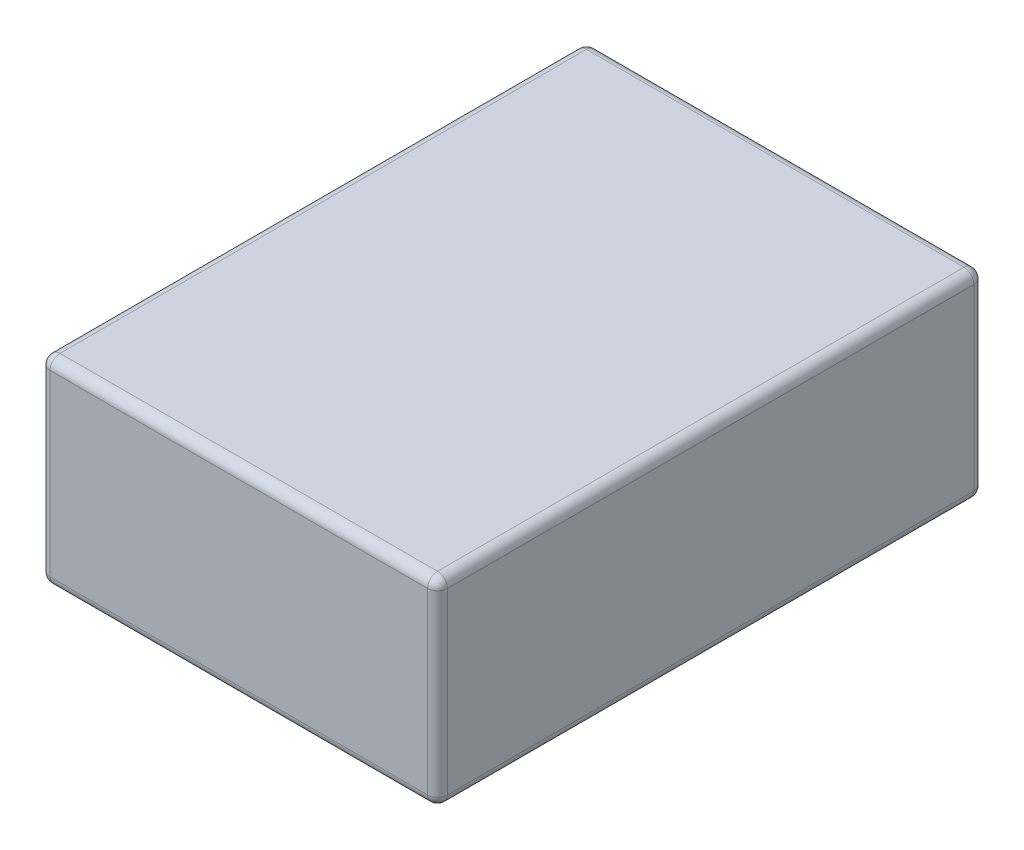
ISO-10303-21;
HEADER;
FILE_DESCRIPTION(('STEP AP214'),'2;1');
FILE_NAME('part.step','',(''),(''),'','','');
FILE_SCHEMA(('AUTOMOTIVE_DESIGN { 1 0 10303 214 1 1 1 1 }'));
ENDSEC;
DATA;
#1=APPLICATION_CONTEXT('core data for automotive mechanical design processes');
#2=APPLICATION_PROTOCOL_DEFINITION('international standard','automotive_design',2000,#1);
#3=PRODUCT_CONTEXT('',#1,'mechanical');
#4=PRODUCT('Part','Part','',(#3));
#5=PRODUCT_RELATED_PRODUCT_CATEGORY('part','',(#4));
#6=PRODUCT_DEFINITION_FORMATION('','',#4);
#7=PRODUCT_DEFINITION_CONTEXT('part definition',#1,'design');
#8=PRODUCT_DEFINITION('design','',#6,#7);
#9=PRODUCT_DEFINITION_SHAPE('','',#8);
#10=(LENGTH_UNIT() NAMED_UNIT(*) SI_UNIT(.MILLI.,.METRE.));
#11=(NAMED_UNIT(*) PLANE_ANGLE_UNIT() SI_UNIT($,.RADIAN.));
#12=(NAMED_UNIT(*) SI_UNIT($,.STERADIAN.) SOLID_ANGLE_UNIT());
#13=UNCERTAINTY_MEASURE_WITH_UNIT(LENGTH_MEASURE(1.E-05),#10,'distance_accuracy_value','');
#14=(GEOMETRIC_REPRESENTATION_CONTEXT(3) GLOBAL_UNCERTAINTY_ASSIGNED_CONTEXT((#13)) GLOBAL_UNIT_ASSIGNED_CONTEXT((#10,
#11,#12)) REPRESENTATION_CONTEXT('',''));
#15=CARTESIAN_POINT('',(0.,0.,0.));
#16=DIRECTION('',(0.,0.,1.));
#17=DIRECTION('',(1.,0.,0.));
#18=AXIS2_PLACEMENT_3D('',#15,#16,#17);
#19=CARTESIAN_POINT('',(0.,20.,0.));
#20=DIRECTION('',(1.,0.,0.));
#21=DIRECTION('',(0.,0.,-1.));
#22=AXIS2_PLACEMENT_3D('',#19,#20,#21);
#23=PLANE('',#22);
#24=DIRECTION('',(0.,-1.,0.));
#25=VECTOR('',#24,1.);
#26=CARTESIAN_POINT('',(0.,20.,-1.));
#27=LINE('',#26,#25);
#28=CARTESIAN_POINT('',(0.,1.,-1.));
#29=VERTEX_POINT('',#28);
#30=CARTESIAN_POINT('',(0.,19.,-1.));
#31=VERTEX_POINT('',#30);
#32=EDGE_CURVE('E137',#29,#31,#27,.F.);
#33=ORIENTED_EDGE('',*,*,#32,.T.);
#34=DIRECTION('',(0.,0.,1.));
#35=VECTOR('',#34,1.);
#36=CARTESIAN_POINT('',(0.,19.,0.));
#37=LINE('',#36,#35);
#38=CARTESIAN_POINT('',(0.,19.,-54.));
#39=VERTEX_POINT('',#38);
#40=EDGE_CURVE('E174',#31,#39,#37,.F.);
#41=ORIENTED_EDGE('',*,*,#40,.T.);
#42=DIRECTION('',(0.,-1.,0.));
#43=VECTOR('',#42,1.);
#44=CARTESIAN_POINT('',(0.,20.,-54.));
#45=LINE('',#44,#43);
#46=CARTESIAN_POINT('',(0.,1.,-54.));
#47=VERTEX_POINT('',#46);
#48=EDGE_CURVE('E171',#39,#47,#45,.T.);
#49=ORIENTED_EDGE('',*,*,#48,.T.);
#50=DIRECTION('',(0.,0.,1.));
#51=VECTOR('',#50,1.);
#52=CARTESIAN_POINT('',(0.,1.,0.));
#53=LINE('',#52,#51);
#54=EDGE_CURVE('E166',#47,#29,#53,.T.);
#55=ORIENTED_EDGE('',*,*,#54,.T.);
#56=EDGE_LOOP('',(#33,#41,#49,#55));
#57=FACE_BOUND('',#56,.T.);
#58=ADVANCED_FACE('F41',(#57),#23,.F.);
#59=CARTESIAN_POINT('',(0.,20.,0.));
#60=DIRECTION('',(0.,0.,-1.));
#61=DIRECTION('',(-1.,0.,0.));
#62=AXIS2_PLACEMENT_3D('',#59,#60,#61);
#63=PLANE('',#62);
#64=DIRECTION('',(0.,-1.,0.));
#65=VECTOR('',#64,1.);
#66=CARTESIAN_POINT('',(39.,20.,0.));
#67=LINE('',#66,#65);
#68=CARTESIAN_POINT('',(39.,1.,0.));
#69=VERTEX_POINT('',#68);
#70=CARTESIAN_POINT('',(39.,19.,0.));
#71=VERTEX_POINT('',#70);
#72=EDGE_CURVE('E159',#69,#71,#67,.F.);
#73=ORIENTED_EDGE('',*,*,#72,.T.);
#74=DIRECTION('',(1.,0.,0.));
#75=VECTOR('',#74,1.);
#76=CARTESIAN_POINT('',(0.,19.,0.));
#77=LINE('',#76,#75);
#78=CARTESIAN_POINT('',(1.,19.,0.));
#79=VERTEX_POINT('',#78);
#80=EDGE_CURVE('E163',#71,#79,#77,.F.);
#81=ORIENTED_EDGE('',*,*,#80,.T.);
#82=DIRECTION('',(0.,-1.,0.));
#83=VECTOR('',#82,1.);
#84=CARTESIAN_POINT('',(1.,20.,0.));
#85=LINE('',#84,#83);
#86=CARTESIAN_POINT('',(1.,1.,0.));
#87=VERTEX_POINT('',#86);
#88=EDGE_CURVE('E135',#79,#87,#85,.T.);
#89=ORIENTED_EDGE('',*,*,#88,.T.);
#90=DIRECTION('',(1.,0.,0.));
#91=VECTOR('',#90,1.);
#92=CARTESIAN_POINT('',(40.,1.,0.));
#93=LINE('',#92,#91);
#94=EDGE_CURVE('E153',#87,#69,#93,.T.);
#95=ORIENTED_EDGE('',*,*,#94,.T.);
#96=EDGE_LOOP('',(#73,#81,#89,#95));
#97=FACE_BOUND('',#96,.T.);
#98=ADVANCED_FACE('F161',(#97),#63,.F.);
#99=CARTESIAN_POINT('',(40.,20.,0.));
#100=DIRECTION('',(-1.,0.,0.));
#101=DIRECTION('',(0.,0.,1.));
#102=AXIS2_PLACEMENT_3D('',#99,#100,#101);
#103=PLANE('',#102);
#104=DIRECTION('',(0.,-1.,0.));
#105=VECTOR('',#104,1.);
#106=CARTESIAN_POINT('',(40.,20.,-54.));
#107=LINE('',#106,#105);
#108=CARTESIAN_POINT('',(40.,1.,-54.));
#109=VERTEX_POINT('',#108);
#110=CARTESIAN_POINT('',(40.,19.,-54.));
#111=VERTEX_POINT('',#110);
#112=EDGE_CURVE('E178',#109,#111,#107,.F.);
#113=ORIENTED_EDGE('',*,*,#112,.T.);
#114=DIRECTION('',(0.,0.,-1.));
#115=VECTOR('',#114,1.);
#116=CARTESIAN_POINT('',(40.,19.,0.));
#117=LINE('',#116,#115);
#118=CARTESIAN_POINT('',(40.,19.,-1.));
#119=VERTEX_POINT('',#118);
#120=EDGE_CURVE('E183',#111,#119,#117,.F.);
#121=ORIENTED_EDGE('',*,*,#120,.T.);
#122=DIRECTION('',(0.,-1.,0.));
#123=VECTOR('',#122,1.);
#124=CARTESIAN_POINT('',(40.,20.,-1.));
#125=LINE('',#124,#123);
#126=CARTESIAN_POINT('',(40.,1.,-1.));
#127=VERTEX_POINT('',#126);
#128=EDGE_CURVE('E180',#119,#127,#125,.T.);
#129=ORIENTED_EDGE('',*,*,#128,.T.);
#130=DIRECTION('',(0.,0.,-1.));
#131=VECTOR('',#130,1.);
#132=CARTESIAN_POINT('',(40.,1.,-55.));
#133=LINE('',#132,#131);
#134=EDGE_CURVE('E176',#127,#109,#133,.T.);
#135=ORIENTED_EDGE('',*,*,#134,.T.);
#136=EDGE_LOOP('',(#113,#121,#129,#135));
#137=FACE_BOUND('',#136,.T.);
#138=ADVANCED_FACE('F288',(#137),#103,.F.);
#139=CARTESIAN_POINT('',(0.,20.,-55.));
#140=DIRECTION('',(0.,0.,1.));
#141=DIRECTION('',(1.,0.,0.));
#142=AXIS2_PLACEMENT_3D('',#139,#140,#141);
#143=PLANE('',#142);
#144=DIRECTION('',(0.,-1.,0.));
#145=VECTOR('',#144,1.);
#146=CARTESIAN_POINT('',(1.,20.,-55.));
#147=LINE('',#146,#145);
#148=CARTESIAN_POINT('',(1.,1.,-55.));
#149=VERTEX_POINT('',#148);
#150=CARTESIAN_POINT('',(1.,19.,-55.));
#151=VERTEX_POINT('',#150);
#152=EDGE_CURVE('E187',#149,#151,#147,.F.);
#153=ORIENTED_EDGE('',*,*,#152,.T.);
#154=DIRECTION('',(-1.,0.,0.));
#155=VECTOR('',#154,1.);
#156=CARTESIAN_POINT('',(0.,19.,-55.));
#157=LINE('',#156,#155);
#158=CARTESIAN_POINT('',(39.,19.,-55.));
#159=VERTEX_POINT('',#158);
#160=EDGE_CURVE('E192',#151,#159,#157,.F.);
#161=ORIENTED_EDGE('',*,*,#160,.T.);
#162=DIRECTION('',(0.,-1.,0.));
#163=VECTOR('',#162,1.);
#164=CARTESIAN_POINT('',(39.,20.,-55.));
#165=LINE('',#164,#163);
#166=CARTESIAN_POINT('',(39.,1.,-55.));
#167=VERTEX_POINT('',#166);
#168=EDGE_CURVE('E189',#159,#167,#165,.T.);
#169=ORIENTED_EDGE('',*,*,#168,.T.);
#170=DIRECTION('',(-1.,0.,0.));
#171=VECTOR('',#170,1.);
#172=CARTESIAN_POINT('',(0.,1.,-55.));
#173=LINE('',#172,#171);
#174=EDGE_CURVE('E185',#167,#149,#173,.T.);
#175=ORIENTED_EDGE('',*,*,#174,.T.);
#176=EDGE_LOOP('',(#153,#161,#169,#175));
#177=FACE_BOUND('',#176,.T.);
#178=ADVANCED_FACE('F299',(#177),#143,.F.);
#179=CARTESIAN_POINT('',(0.,20.,0.));
#180=DIRECTION('',(0.,-1.,0.));
#181=DIRECTION('',(0.,0.,-1.));
#182=AXIS2_PLACEMENT_3D('',#179,#180,#181);
#183=PLANE('',#182);
#184=DIRECTION('',(0.,0.,-1.));
#185=VECTOR('',#184,1.);
#186=CARTESIAN_POINT('',(39.,20.,0.));
#187=LINE('',#186,#185);
#188=CARTESIAN_POINT('',(39.,20.,-1.));
#189=VERTEX_POINT('',#188);
#190=CARTESIAN_POINT('',(39.,20.,-54.));
#191=VERTEX_POINT('',#190);
#192=EDGE_CURVE('E198',#189,#191,#187,.T.);
#193=ORIENTED_EDGE('',*,*,#192,.T.);
#194=DIRECTION('',(-1.,0.,0.));
#195=VECTOR('',#194,1.);
#196=CARTESIAN_POINT('',(0.,20.,-54.));
#197=LINE('',#196,#195);
#198=CARTESIAN_POINT('',(1.,20.,-54.));
#199=VERTEX_POINT('',#198);
#200=EDGE_CURVE('E200',#191,#199,#197,.T.);
#201=ORIENTED_EDGE('',*,*,#200,.T.);
#202=DIRECTION('',(0.,0.,1.));
#203=VECTOR('',#202,1.);
#204=CARTESIAN_POINT('',(1.,20.,0.));
#205=LINE('',#204,#203);
#206=CARTESIAN_POINT('',(1.,20.,-1.));
#207=VERTEX_POINT('',#206);
#208=EDGE_CURVE('E194',#199,#207,#205,.T.);
#209=ORIENTED_EDGE('',*,*,#208,.T.);
#210=DIRECTION('',(1.,0.,0.));
#211=VECTOR('',#210,1.);
#212=CARTESIAN_POINT('',(0.,20.,-1.));
#213=LINE('',#212,#211);
#214=EDGE_CURVE('E196',#207,#189,#213,.T.);
#215=ORIENTED_EDGE('',*,*,#214,.T.);
#216=EDGE_LOOP('',(#193,#201,#209,#215));
#217=FACE_BOUND('',#216,.T.);
#218=ADVANCED_FACE('F280',(#217),#183,.F.);
#219=CARTESIAN_POINT('',(0.,0.,0.));
#220=DIRECTION('',(0.,-1.,0.));
#221=DIRECTION('',(0.,0.,-1.));
#222=AXIS2_PLACEMENT_3D('',#219,#220,#221);
#223=PLANE('',#222);
#224=DIRECTION('',(0.,0.,-1.));
#225=VECTOR('',#224,1.);
#226=CARTESIAN_POINT('',(39.,0.,0.));
#227=LINE('',#226,#225);
#228=CARTESIAN_POINT('',(39.,0.,-54.));
#229=VERTEX_POINT('',#228);
#230=CARTESIAN_POINT('',(39.,0.,-1.));
#231=VERTEX_POINT('',#230);
#232=EDGE_CURVE('E50',#229,#231,#227,.F.);
#233=ORIENTED_EDGE('',*,*,#232,.T.);
#234=DIRECTION('',(1.,0.,0.));
#235=VECTOR('',#234,1.);
#236=CARTESIAN_POINT('',(0.,0.,-1.));
#237=LINE('',#236,#235);
#238=CARTESIAN_POINT('',(1.,0.,-1.));
#239=VERTEX_POINT('',#238);
#240=EDGE_CURVE('E12',#231,#239,#237,.F.);
#241=ORIENTED_EDGE('',*,*,#240,.T.);
#242=DIRECTION('',(0.,0.,1.));
#243=VECTOR('',#242,1.);
#244=CARTESIAN_POINT('',(1.,0.,-55.));
#245=LINE('',#244,#243);
#246=CARTESIAN_POINT('',(1.,0.,-54.));
#247=VERTEX_POINT('',#246);
#248=EDGE_CURVE('E203',#239,#247,#245,.F.);
#249=ORIENTED_EDGE('',*,*,#248,.T.);
#250=DIRECTION('',(-1.,0.,0.));
#251=VECTOR('',#250,1.);
#252=CARTESIAN_POINT('',(40.,0.,-54.));
#253=LINE('',#252,#251);
#254=EDGE_CURVE('E61',#247,#229,#253,.F.);
#255=ORIENTED_EDGE('',*,*,#254,.T.);
#256=EDGE_LOOP('',(#233,#241,#249,#255));
#257=FACE_BOUND('',#256,.T.);
#258=ADVANCED_FACE('F401',(#257),#223,.T.);
#259=CARTESIAN_POINT('',(39.,20.,-54.));
#260=DIRECTION('',(0.,-1.,0.));
#261=DIRECTION('',(0.,0.,-1.));
#262=AXIS2_PLACEMENT_3D('',#259,#260,#261);
#263=CYLINDRICAL_SURFACE('',#262,1.);
#264=CARTESIAN_POINT('',(39.,19.,-54.));
#265=DIRECTION('',(0.,1.,0.));
#266=DIRECTION('',(0.,0.,1.));
#267=AXIS2_PLACEMENT_3D('',#264,#265,#266);
#268=CIRCLE('',#267,1.);
#269=EDGE_CURVE('E45',#111,#159,#268,.T.);
#270=ORIENTED_EDGE('',*,*,#269,.F.);
#271=ORIENTED_EDGE('',*,*,#112,.F.);
#272=CARTESIAN_POINT('',(39.,1.,-54.));
#273=DIRECTION('',(0.,-1.,0.));
#274=DIRECTION('',(0.,0.,-1.));
#275=AXIS2_PLACEMENT_3D('',#272,#273,#274);
#276=CIRCLE('',#275,1.);
#277=EDGE_CURVE('E257',#167,#109,#276,.T.);
#278=ORIENTED_EDGE('',*,*,#277,.F.);
#279=ORIENTED_EDGE('',*,*,#168,.F.);
#280=EDGE_LOOP('',(#270,#271,#278,#279));
#281=FACE_BOUND('',#280,.T.);
#282=ADVANCED_FACE('F43',(#281),#263,.T.);
#283=CARTESIAN_POINT('',(39.,19.,-54.));
#284=DIRECTION('',(0.,0.,-1.));
#285=DIRECTION('',(-1.,0.,0.));
#286=AXIS2_PLACEMENT_3D('',#283,#284,#285);
#287=SPHERICAL_SURFACE('',#286,1.);
#288=CARTESIAN_POINT('',(39.,19.,-54.));
#289=DIRECTION('',(0.,0.,-1.));
#290=DIRECTION('',(-1.,0.,0.));
#291=AXIS2_PLACEMENT_3D('',#288,#289,#290);
#292=CIRCLE('',#291,1.);
#293=EDGE_CURVE('E252',#111,#191,#292,.F.);
#294=ORIENTED_EDGE('',*,*,#293,.F.);
#295=ORIENTED_EDGE('',*,*,#269,.T.);
#296=CARTESIAN_POINT('',(39.,19.,-54.));
#297=DIRECTION('',(1.,0.,0.));
#298=DIRECTION('',(0.,0.,-1.));
#299=AXIS2_PLACEMENT_3D('',#296,#297,#298);
#300=CIRCLE('',#299,1.);
#301=EDGE_CURVE('E255',#191,#159,#300,.F.);
#302=ORIENTED_EDGE('',*,*,#301,.F.);
#303=EDGE_LOOP('',(#294,#295,#302));
#304=FACE_BOUND('',#303,.T.);
#305=ADVANCED_FACE('F268',(#304),#287,.T.);
#306=CARTESIAN_POINT('',(39.,1.,-54.));
#307=DIRECTION('',(1.,0.,0.));
#308=DIRECTION('',(0.,1.,0.));
#309=AXIS2_PLACEMENT_3D('',#306,#307,#308);
#310=SPHERICAL_SURFACE('',#309,1.);
#311=CARTESIAN_POINT('',(39.,1.,-54.));
#312=DIRECTION('',(1.,0.,0.));
#313=DIRECTION('',(0.,0.,-1.));
#314=AXIS2_PLACEMENT_3D('',#311,#312,#313);
#315=CIRCLE('',#314,1.);
#316=EDGE_CURVE('E247',#167,#229,#315,.F.);
#317=ORIENTED_EDGE('',*,*,#316,.F.);
#318=ORIENTED_EDGE('',*,*,#277,.T.);
#319=CARTESIAN_POINT('',(39.,1.,-54.));
#320=DIRECTION('',(0.,0.,-1.));
#321=DIRECTION('',(-1.,0.,0.));
#322=AXIS2_PLACEMENT_3D('',#319,#320,#321);
#323=CIRCLE('',#322,1.);
#324=EDGE_CURVE('E249',#229,#109,#323,.F.);
#325=ORIENTED_EDGE('',*,*,#324,.F.);
#326=EDGE_LOOP('',(#317,#318,#325));
#327=FACE_BOUND('',#326,.T.);
#328=ADVANCED_FACE('F426',(#327),#310,.T.);
#329=CARTESIAN_POINT('',(0.,19.,-54.));
#330=DIRECTION('',(-1.,0.,0.));
#331=DIRECTION('',(0.,0.,1.));
#332=AXIS2_PLACEMENT_3D('',#329,#330,#331);
#333=CYLINDRICAL_SURFACE('',#332,1.);
#334=ORIENTED_EDGE('',*,*,#301,.T.);
#335=ORIENTED_EDGE('',*,*,#160,.F.);
#336=CARTESIAN_POINT('',(1.,19.,-54.));
#337=DIRECTION('',(-1.,0.,0.));
#338=DIRECTION('',(0.,0.,1.));
#339=AXIS2_PLACEMENT_3D('',#336,#337,#338);
#340=CIRCLE('',#339,1.);
#341=EDGE_CURVE('E241',#199,#151,#340,.T.);
#342=ORIENTED_EDGE('',*,*,#341,.F.);
#343=ORIENTED_EDGE('',*,*,#200,.F.);
#344=EDGE_LOOP('',(#334,#335,#342,#343));
#345=FACE_BOUND('',#344,.T.);
#346=ADVANCED_FACE('F276',(#345),#333,.T.);
#347=CARTESIAN_POINT('',(39.,19.,0.));
#348=DIRECTION('',(0.,0.,-1.));
#349=DIRECTION('',(-1.,0.,0.));
#350=AXIS2_PLACEMENT_3D('',#347,#348,#349);
#351=CYLINDRICAL_SURFACE('',#350,1.);
#352=ORIENTED_EDGE('',*,*,#293,.T.);
#353=ORIENTED_EDGE('',*,*,#192,.F.);
#354=CARTESIAN_POINT('',(39.,19.,-1.));
#355=DIRECTION('',(0.,0.,1.));
#356=DIRECTION('',(1.,0.,0.));
#357=AXIS2_PLACEMENT_3D('',#354,#355,#356);
#358=CIRCLE('',#357,1.);
#359=EDGE_CURVE('E238',#119,#189,#358,.T.);
#360=ORIENTED_EDGE('',*,*,#359,.F.);
#361=ORIENTED_EDGE('',*,*,#120,.F.);
#362=EDGE_LOOP('',(#352,#353,#360,#361));
#363=FACE_BOUND('',#362,.T.);
#364=ADVANCED_FACE('F285',(#363),#351,.T.);
#365=CARTESIAN_POINT('',(39.,20.,-1.));
#366=DIRECTION('',(0.,-1.,0.));
#367=DIRECTION('',(0.,0.,-1.));
#368=AXIS2_PLACEMENT_3D('',#365,#366,#367);
#369=CYLINDRICAL_SURFACE('',#368,1.);
#370=CARTESIAN_POINT('',(39.,1.,-1.));
#371=DIRECTION('',(0.,-1.,0.));
#372=DIRECTION('',(0.,0.,-1.));
#373=AXIS2_PLACEMENT_3D('',#370,#371,#372);
#374=CIRCLE('',#373,1.);
#375=EDGE_CURVE('E232',#127,#69,#374,.T.);
#376=ORIENTED_EDGE('',*,*,#375,.F.);
#377=ORIENTED_EDGE('',*,*,#128,.F.);
#378=CARTESIAN_POINT('',(39.,19.,-1.));
#379=DIRECTION('',(0.,1.,0.));
#380=DIRECTION('',(0.,0.,1.));
#381=AXIS2_PLACEMENT_3D('',#378,#379,#380);
#382=CIRCLE('',#381,1.);
#383=EDGE_CURVE('E235',#71,#119,#382,.T.);
#384=ORIENTED_EDGE('',*,*,#383,.F.);
#385=ORIENTED_EDGE('',*,*,#72,.F.);
#386=EDGE_LOOP('',(#376,#377,#384,#385));
#387=FACE_BOUND('',#386,.T.);
#388=ADVANCED_FACE('F292',(#387),#369,.T.);
#389=CARTESIAN_POINT('',(39.,1.,0.));
#390=DIRECTION('',(0.,0.,1.));
#391=DIRECTION('',(1.,0.,0.));
#392=AXIS2_PLACEMENT_3D('',#389,#390,#391);
#393=CYLINDRICAL_SURFACE('',#392,1.);
#394=ORIENTED_EDGE('',*,*,#324,.T.);
#395=ORIENTED_EDGE('',*,*,#134,.F.);
#396=CARTESIAN_POINT('',(39.,1.,-1.));
#397=DIRECTION('',(0.,0.,1.));
#398=DIRECTION('',(1.,0.,0.));
#399=AXIS2_PLACEMENT_3D('',#396,#397,#398);
#400=CIRCLE('',#399,1.);
#401=EDGE_CURVE('E230',#231,#127,#400,.T.);
#402=ORIENTED_EDGE('',*,*,#401,.F.);
#403=ORIENTED_EDGE('',*,*,#232,.F.);
#404=EDGE_LOOP('',(#394,#395,#402,#403));
#405=FACE_BOUND('',#404,.T.);
#406=ADVANCED_FACE('F297',(#405),#393,.T.);
#407=CARTESIAN_POINT('',(0.,1.,-54.));
#408=DIRECTION('',(1.,0.,0.));
#409=DIRECTION('',(0.,0.,-1.));
#410=AXIS2_PLACEMENT_3D('',#407,#408,#409);
#411=CYLINDRICAL_SURFACE('',#410,1.);
#412=ORIENTED_EDGE('',*,*,#316,.T.);
#413=ORIENTED_EDGE('',*,*,#254,.F.);
#414=CARTESIAN_POINT('',(1.,1.,-54.));
#415=DIRECTION('',(-1.,0.,0.));
#416=DIRECTION('',(0.,0.,1.));
#417=AXIS2_PLACEMENT_3D('',#414,#415,#416);
#418=CIRCLE('',#417,1.);
#419=EDGE_CURVE('E227',#149,#247,#418,.T.);
#420=ORIENTED_EDGE('',*,*,#419,.F.);
#421=ORIENTED_EDGE('',*,*,#174,.F.);
#422=EDGE_LOOP('',(#412,#413,#420,#421));
#423=FACE_BOUND('',#422,.T.);
#424=ADVANCED_FACE('F308',(#423),#411,.T.);
#425=CARTESIAN_POINT('',(1.,20.,-54.));
#426=DIRECTION('',(0.,-1.,0.));
#427=DIRECTION('',(0.,0.,-1.));
#428=AXIS2_PLACEMENT_3D('',#425,#426,#427);
#429=CYLINDRICAL_SURFACE('',#428,1.);
#430=CARTESIAN_POINT('',(1.,19.,-54.));
#431=DIRECTION('',(0.,1.,0.));
#432=DIRECTION('',(0.,0.,1.));
#433=AXIS2_PLACEMENT_3D('',#430,#431,#432);
#434=CIRCLE('',#433,1.);
#435=EDGE_CURVE('E244',#151,#39,#434,.T.);
#436=ORIENTED_EDGE('',*,*,#435,.F.);
#437=ORIENTED_EDGE('',*,*,#152,.F.);
#438=CARTESIAN_POINT('',(1.,1.,-54.));
#439=DIRECTION('',(0.,-1.,0.));
#440=DIRECTION('',(0.,0.,-1.));
#441=AXIS2_PLACEMENT_3D('',#438,#439,#440);
#442=CIRCLE('',#441,1.);
#443=EDGE_CURVE('E224',#47,#149,#442,.T.);
#444=ORIENTED_EDGE('',*,*,#443,.F.);
#445=ORIENTED_EDGE('',*,*,#48,.F.);
#446=EDGE_LOOP('',(#436,#437,#444,#445));
#447=FACE_BOUND('',#446,.T.);
#448=ADVANCED_FACE('F304',(#447),#429,.T.);
#449=CARTESIAN_POINT('',(1.,19.,-54.));
#450=DIRECTION('',(0.,0.,-1.));
#451=DIRECTION('',(-1.,0.,0.));
#452=AXIS2_PLACEMENT_3D('',#449,#450,#451);
#453=SPHERICAL_SURFACE('',#452,1.);
#454=ORIENTED_EDGE('',*,*,#341,.T.);
#455=ORIENTED_EDGE('',*,*,#435,.T.);
#456=CARTESIAN_POINT('',(1.,19.,-54.));
#457=DIRECTION('',(0.,0.,-1.));
#458=DIRECTION('',(-1.,0.,0.));
#459=AXIS2_PLACEMENT_3D('',#456,#457,#458);
#460=CIRCLE('',#459,1.);
#461=EDGE_CURVE('E221',#199,#39,#460,.F.);
#462=ORIENTED_EDGE('',*,*,#461,.F.);
#463=EDGE_LOOP('',(#454,#455,#462));
#464=FACE_BOUND('',#463,.T.);
#465=ADVANCED_FACE('F318',(#464),#453,.T.);
#466=CARTESIAN_POINT('',(39.,19.,-1.));
#467=DIRECTION('',(1.,0.,0.));
#468=DIRECTION('',(0.,0.,-1.));
#469=AXIS2_PLACEMENT_3D('',#466,#467,#468);
#470=SPHERICAL_SURFACE('',#469,1.);
#471=ORIENTED_EDGE('',*,*,#383,.T.);
#472=ORIENTED_EDGE('',*,*,#359,.T.);
#473=CARTESIAN_POINT('',(39.,19.,-1.));
#474=DIRECTION('',(1.,0.,0.));
#475=DIRECTION('',(0.,0.,-1.));
#476=AXIS2_PLACEMENT_3D('',#473,#474,#475);
#477=CIRCLE('',#476,1.);
#478=EDGE_CURVE('E218',#71,#189,#477,.F.);
#479=ORIENTED_EDGE('',*,*,#478,.F.);
#480=EDGE_LOOP('',(#471,#472,#479));
#481=FACE_BOUND('',#480,.T.);
#482=ADVANCED_FACE('F328',(#481),#470,.T.);
#483=CARTESIAN_POINT('',(39.,1.,-1.));
#484=DIRECTION('',(1.,0.,0.));
#485=DIRECTION('',(0.,1.,0.));
#486=AXIS2_PLACEMENT_3D('',#483,#484,#485);
#487=SPHERICAL_SURFACE('',#486,1.);
#488=ORIENTED_EDGE('',*,*,#401,.T.);
#489=ORIENTED_EDGE('',*,*,#375,.T.);
#490=CARTESIAN_POINT('',(39.,1.,-1.));
#491=DIRECTION('',(1.,0.,0.));
#492=DIRECTION('',(0.,0.,-1.));
#493=AXIS2_PLACEMENT_3D('',#490,#491,#492);
#494=CIRCLE('',#493,1.);
#495=EDGE_CURVE('E156',#231,#69,#494,.F.);
#496=ORIENTED_EDGE('',*,*,#495,.F.);
#497=EDGE_LOOP('',(#488,#489,#496));
#498=FACE_BOUND('',#497,.T.);
#499=ADVANCED_FACE('F330',(#498),#487,.T.);
#500=CARTESIAN_POINT('',(1.,1.,-54.));
#501=DIRECTION('',(0.,0.,-1.));
#502=DIRECTION('',(0.,1.,0.));
#503=AXIS2_PLACEMENT_3D('',#500,#501,#502);
#504=SPHERICAL_SURFACE('',#503,1.);
#505=ORIENTED_EDGE('',*,*,#443,.T.);
#506=ORIENTED_EDGE('',*,*,#419,.T.);
#507=CARTESIAN_POINT('',(1.,1.,-54.));
#508=DIRECTION('',(0.,0.,-1.));
#509=DIRECTION('',(-1.,0.,0.));
#510=AXIS2_PLACEMENT_3D('',#507,#508,#509);
#511=CIRCLE('',#510,1.);
#512=EDGE_CURVE('E214',#47,#247,#511,.F.);
#513=ORIENTED_EDGE('',*,*,#512,.F.);
#514=EDGE_LOOP('',(#505,#506,#513));
#515=FACE_BOUND('',#514,.T.);
#516=ADVANCED_FACE('F310',(#515),#504,.T.);
#517=CARTESIAN_POINT('',(1.,19.,0.));
#518=DIRECTION('',(0.,0.,1.));
#519=DIRECTION('',(1.,0.,0.));
#520=AXIS2_PLACEMENT_3D('',#517,#518,#519);
#521=CYLINDRICAL_SURFACE('',#520,1.);
#522=ORIENTED_EDGE('',*,*,#461,.T.);
#523=ORIENTED_EDGE('',*,*,#40,.F.);
#524=CARTESIAN_POINT('',(1.,19.,-1.));
#525=DIRECTION('',(0.,0.,1.));
#526=DIRECTION('',(1.,0.,0.));
#527=AXIS2_PLACEMENT_3D('',#524,#525,#526);
#528=CIRCLE('',#527,1.);
#529=EDGE_CURVE('E211',#207,#31,#528,.T.);
#530=ORIENTED_EDGE('',*,*,#529,.F.);
#531=ORIENTED_EDGE('',*,*,#208,.F.);
#532=EDGE_LOOP('',(#522,#523,#530,#531));
#533=FACE_BOUND('',#532,.T.);
#534=ADVANCED_FACE('F320',(#533),#521,.T.);
#535=CARTESIAN_POINT('',(0.,19.,-1.));
#536=DIRECTION('',(1.,0.,0.));
#537=DIRECTION('',(0.,0.,-1.));
#538=AXIS2_PLACEMENT_3D('',#535,#536,#537);
#539=CYLINDRICAL_SURFACE('',#538,1.);
#540=ORIENTED_EDGE('',*,*,#478,.T.);
#541=ORIENTED_EDGE('',*,*,#214,.F.);
#542=CARTESIAN_POINT('',(1.,19.,-1.));
#543=DIRECTION('',(-1.,0.,0.));
#544=DIRECTION('',(0.,0.,1.));
#545=AXIS2_PLACEMENT_3D('',#542,#543,#544);
#546=CIRCLE('',#545,1.);
#547=EDGE_CURVE('E150',#79,#207,#546,.T.);
#548=ORIENTED_EDGE('',*,*,#547,.F.);
#549=ORIENTED_EDGE('',*,*,#80,.F.);
#550=EDGE_LOOP('',(#540,#541,#548,#549));
#551=FACE_BOUND('',#550,.T.);
#552=ADVANCED_FACE('F326',(#551),#539,.T.);
#553=CARTESIAN_POINT('',(0.,1.,-1.));
#554=DIRECTION('',(-1.,0.,0.));
#555=DIRECTION('',(0.,0.,1.));
#556=AXIS2_PLACEMENT_3D('',#553,#554,#555);
#557=CYLINDRICAL_SURFACE('',#556,1.);
#558=ORIENTED_EDGE('',*,*,#495,.T.);
#559=ORIENTED_EDGE('',*,*,#94,.F.);
#560=CARTESIAN_POINT('',(1.,1.,-1.));
#561=DIRECTION('',(-1.,0.,0.));
#562=DIRECTION('',(0.,0.,1.));
#563=AXIS2_PLACEMENT_3D('',#560,#561,#562);
#564=CIRCLE('',#563,1.);
#565=EDGE_CURVE('E142',#239,#87,#564,.T.);
#566=ORIENTED_EDGE('',*,*,#565,.F.);
#567=ORIENTED_EDGE('',*,*,#240,.F.);
#568=EDGE_LOOP('',(#558,#559,#566,#567));
#569=FACE_BOUND('',#568,.T.);
#570=ADVANCED_FACE('F154',(#569),#557,.T.);
#571=CARTESIAN_POINT('',(1.,1.,0.));
#572=DIRECTION('',(0.,0.,-1.));
#573=DIRECTION('',(-1.,0.,0.));
#574=AXIS2_PLACEMENT_3D('',#571,#572,#573);
#575=CYLINDRICAL_SURFACE('',#574,1.);
#576=ORIENTED_EDGE('',*,*,#512,.T.);
#577=ORIENTED_EDGE('',*,*,#248,.F.);
#578=CARTESIAN_POINT('',(1.,1.,-1.));
#579=DIRECTION('',(0.,0.,1.));
#580=DIRECTION('',(1.,0.,0.));
#581=AXIS2_PLACEMENT_3D('',#578,#579,#580);
#582=CIRCLE('',#581,1.);
#583=EDGE_CURVE('E146',#29,#239,#582,.T.);
#584=ORIENTED_EDGE('',*,*,#583,.F.);
#585=ORIENTED_EDGE('',*,*,#54,.F.);
#586=EDGE_LOOP('',(#576,#577,#584,#585));
#587=FACE_BOUND('',#586,.T.);
#588=ADVANCED_FACE('F313',(#587),#575,.T.);
#589=CARTESIAN_POINT('',(1.,19.,-1.));
#590=DIRECTION('',(0.,1.,0.));
#591=DIRECTION('',(0.,0.,1.));
#592=AXIS2_PLACEMENT_3D('',#589,#590,#591);
#593=SPHERICAL_SURFACE('',#592,1.);
#594=ORIENTED_EDGE('',*,*,#547,.T.);
#595=ORIENTED_EDGE('',*,*,#529,.T.);
#596=CARTESIAN_POINT('',(1.,19.,-1.));
#597=DIRECTION('',(0.,1.,0.));
#598=DIRECTION('',(0.,0.,1.));
#599=AXIS2_PLACEMENT_3D('',#596,#597,#598);
#600=CIRCLE('',#599,1.);
#601=EDGE_CURVE('E139',#79,#31,#600,.F.);
#602=ORIENTED_EDGE('',*,*,#601,.F.);
#603=EDGE_LOOP('',(#594,#595,#602));
#604=FACE_BOUND('',#603,.T.);
#605=ADVANCED_FACE('F324',(#604),#593,.T.);
#606=CARTESIAN_POINT('',(1.,1.,-1.));
#607=DIRECTION('',(0.,-1.,0.));
#608=DIRECTION('',(0.,0.,-1.));
#609=AXIS2_PLACEMENT_3D('',#606,#607,#608);
#610=SPHERICAL_SURFACE('',#609,1.);
#611=ORIENTED_EDGE('',*,*,#583,.T.);
#612=ORIENTED_EDGE('',*,*,#565,.T.);
#613=CARTESIAN_POINT('',(1.,1.,-1.));
#614=DIRECTION('',(0.,-1.,0.));
#615=DIRECTION('',(0.,0.,-1.));
#616=AXIS2_PLACEMENT_3D('',#613,#614,#615);
#617=CIRCLE('',#616,1.);
#618=EDGE_CURVE('E131',#29,#87,#617,.F.);
#619=ORIENTED_EDGE('',*,*,#618,.F.);
#620=EDGE_LOOP('',(#611,#612,#619));
#621=FACE_BOUND('',#620,.T.);
#622=ADVANCED_FACE('F144',(#621),#610,.T.);
#623=CARTESIAN_POINT('',(1.,20.,-1.));
#624=DIRECTION('',(0.,-1.,0.));
#625=DIRECTION('',(0.,0.,-1.));
#626=AXIS2_PLACEMENT_3D('',#623,#624,#625);
#627=CYLINDRICAL_SURFACE('',#626,1.);
#628=ORIENTED_EDGE('',*,*,#601,.T.);
#629=ORIENTED_EDGE('',*,*,#32,.F.);
#630=ORIENTED_EDGE('',*,*,#618,.T.);
#631=ORIENTED_EDGE('',*,*,#88,.F.);
#632=EDGE_LOOP('',(#628,#629,#630,#631));
#633=FACE_BOUND('',#632,.T.);
#634=ADVANCED_FACE('F133',(#633),#627,.T.);
#635=CLOSED_SHELL('',(#58,#98,#138,#178,#218,#258,#282,#305,#328,#346,#364,#388,#406,#424,#448,
#465,#482,#499,#516,#534,#552,#570,#588,#605,#622,#634));
#636=MANIFOLD_SOLID_BREP('B2',#635);
#637=ADVANCED_BREP_SHAPE_REPRESENTATION('',(#18,#636),#14);
#638=SHAPE_DEFINITION_REPRESENTATION(#9,#637);
ENDSEC;
END-ISO-10303-21;
